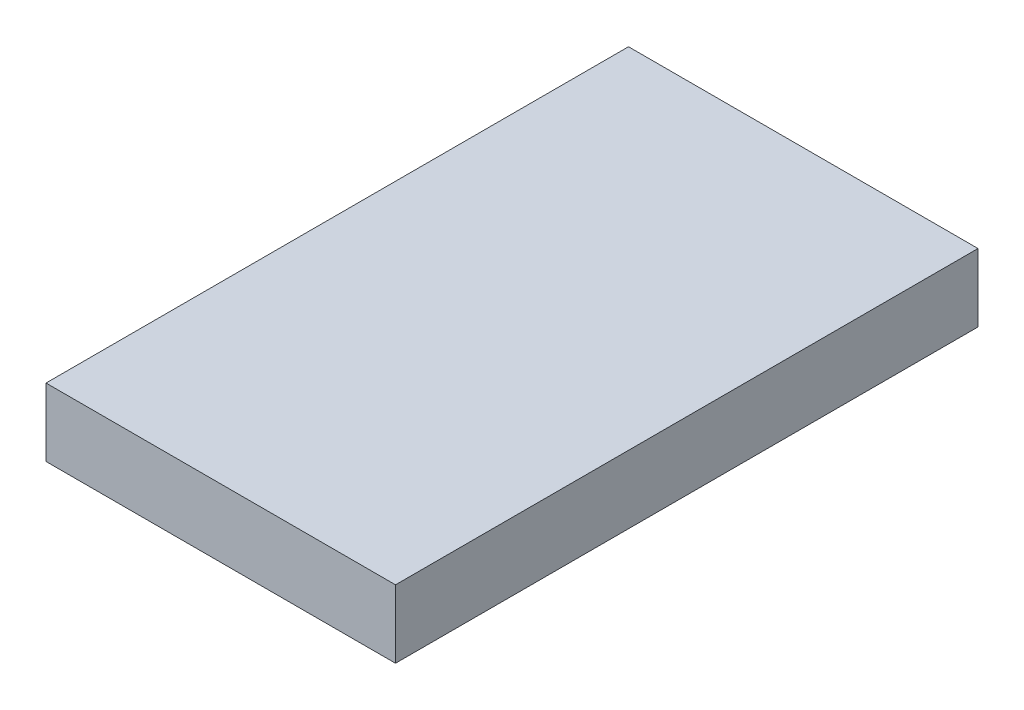
ISO-10303-21;
HEADER;
FILE_DESCRIPTION(('STEP AP214'),'2;1');
FILE_NAME('part.step','',(''),(''),'','','');
FILE_SCHEMA(('AUTOMOTIVE_DESIGN { 1 0 10303 214 1 1 1 1 }'));
ENDSEC;
DATA;
#1=APPLICATION_CONTEXT('core data for automotive mechanical design processes');
#2=APPLICATION_PROTOCOL_DEFINITION('international standard','automotive_design',2000,#1);
#3=PRODUCT_CONTEXT('',#1,'mechanical');
#4=PRODUCT('Part','Part','',(#3));
#5=PRODUCT_RELATED_PRODUCT_CATEGORY('part','',(#4));
#6=PRODUCT_DEFINITION_FORMATION('','',#4);
#7=PRODUCT_DEFINITION_CONTEXT('part definition',#1,'design');
#8=PRODUCT_DEFINITION('design','',#6,#7);
#9=PRODUCT_DEFINITION_SHAPE('','',#8);
#10=(LENGTH_UNIT() NAMED_UNIT(*) SI_UNIT(.MILLI.,.METRE.));
#11=(NAMED_UNIT(*) PLANE_ANGLE_UNIT() SI_UNIT($,.RADIAN.));
#12=(NAMED_UNIT(*) SI_UNIT($,.STERADIAN.) SOLID_ANGLE_UNIT());
#13=UNCERTAINTY_MEASURE_WITH_UNIT(LENGTH_MEASURE(1.E-05),#10,'distance_accuracy_value','');
#14=(GEOMETRIC_REPRESENTATION_CONTEXT(3) GLOBAL_UNCERTAINTY_ASSIGNED_CONTEXT((#13)) GLOBAL_UNIT_ASSIGNED_CONTEXT((#10,
#11,#12)) REPRESENTATION_CONTEXT('',''));
#15=CARTESIAN_POINT('',(0.,0.,0.));
#16=DIRECTION('',(0.,0.,1.));
#17=DIRECTION('',(1.,0.,0.));
#18=AXIS2_PLACEMENT_3D('',#15,#16,#17);
#19=CARTESIAN_POINT('',(18.,3.5,-30.));
#20=DIRECTION('',(-1.,0.,0.));
#21=DIRECTION('',(0.,0.,1.));
#22=AXIS2_PLACEMENT_3D('',#19,#20,#21);
#23=PLANE('',#22);
#24=DIRECTION('',(0.,0.,-1.));
#25=VECTOR('',#24,1.);
#26=CARTESIAN_POINT('',(18.,-3.5,-30.));
#27=LINE('',#26,#25);
#28=CARTESIAN_POINT('',(18.,-3.5,30.));
#29=VERTEX_POINT('',#28);
#30=CARTESIAN_POINT('',(18.,-3.5,-30.));
#31=VERTEX_POINT('',#30);
#32=EDGE_CURVE('E113',#29,#31,#27,.T.);
#33=ORIENTED_EDGE('',*,*,#32,.T.);
#34=DIRECTION('',(0.,-1.,0.));
#35=VECTOR('',#34,1.);
#36=CARTESIAN_POINT('',(18.,3.5,-30.));
#37=LINE('',#36,#35);
#38=CARTESIAN_POINT('',(18.,3.5,-30.));
#39=VERTEX_POINT('',#38);
#40=EDGE_CURVE('E11',#39,#31,#37,.T.);
#41=ORIENTED_EDGE('',*,*,#40,.F.);
#42=DIRECTION('',(0.,0.,-1.));
#43=VECTOR('',#42,1.);
#44=CARTESIAN_POINT('',(18.,3.5,-30.));
#45=LINE('',#44,#43);
#46=CARTESIAN_POINT('',(18.,3.5,30.));
#47=VERTEX_POINT('',#46);
#48=EDGE_CURVE('E97',#47,#39,#45,.T.);
#49=ORIENTED_EDGE('',*,*,#48,.F.);
#50=DIRECTION('',(0.,-1.,0.));
#51=VECTOR('',#50,1.);
#52=CARTESIAN_POINT('',(18.,3.5,30.));
#53=LINE('',#52,#51);
#54=EDGE_CURVE('E109',#47,#29,#53,.T.);
#55=ORIENTED_EDGE('',*,*,#54,.T.);
#56=EDGE_LOOP('',(#33,#41,#49,#55));
#57=FACE_BOUND('',#56,.T.);
#58=ADVANCED_FACE('F45',(#57),#23,.F.);
#59=CARTESIAN_POINT('',(-18.,3.5,-30.));
#60=DIRECTION('',(0.,0.,1.));
#61=DIRECTION('',(1.,0.,0.));
#62=AXIS2_PLACEMENT_3D('',#59,#60,#61);
#63=PLANE('',#62);
#64=DIRECTION('',(-1.,0.,0.));
#65=VECTOR('',#64,1.);
#66=CARTESIAN_POINT('',(-18.,-3.5,-30.));
#67=LINE('',#66,#65);
#68=CARTESIAN_POINT('',(-18.,-3.5,-30.));
#69=VERTEX_POINT('',#68);
#70=EDGE_CURVE('E102',#31,#69,#67,.T.);
#71=ORIENTED_EDGE('',*,*,#70,.T.);
#72=DIRECTION('',(0.,-1.,0.));
#73=VECTOR('',#72,1.);
#74=CARTESIAN_POINT('',(-18.,3.5,-30.));
#75=LINE('',#74,#73);
#76=CARTESIAN_POINT('',(-18.,3.5,-30.));
#77=VERTEX_POINT('',#76);
#78=EDGE_CURVE('E54',#77,#69,#75,.T.);
#79=ORIENTED_EDGE('',*,*,#78,.F.);
#80=DIRECTION('',(-1.,0.,0.));
#81=VECTOR('',#80,1.);
#82=CARTESIAN_POINT('',(-18.,3.5,-30.));
#83=LINE('',#82,#81);
#84=EDGE_CURVE('E92',#39,#77,#83,.T.);
#85=ORIENTED_EDGE('',*,*,#84,.F.);
#86=ORIENTED_EDGE('',*,*,#40,.T.);
#87=EDGE_LOOP('',(#71,#79,#85,#86));
#88=FACE_BOUND('',#87,.T.);
#89=ADVANCED_FACE('F101',(#88),#63,.F.);
#90=CARTESIAN_POINT('',(-18.,3.5,-30.));
#91=DIRECTION('',(1.,0.,0.));
#92=DIRECTION('',(0.,0.,-1.));
#93=AXIS2_PLACEMENT_3D('',#90,#91,#92);
#94=PLANE('',#93);
#95=DIRECTION('',(0.,0.,1.));
#96=VECTOR('',#95,1.);
#97=CARTESIAN_POINT('',(-18.,-3.5,-30.));
#98=LINE('',#97,#96);
#99=CARTESIAN_POINT('',(-18.,-3.5,30.));
#100=VERTEX_POINT('',#99);
#101=EDGE_CURVE('E79',#69,#100,#98,.T.);
#102=ORIENTED_EDGE('',*,*,#101,.T.);
#103=DIRECTION('',(0.,-1.,0.));
#104=VECTOR('',#103,1.);
#105=CARTESIAN_POINT('',(-18.,3.5,30.));
#106=LINE('',#105,#104);
#107=CARTESIAN_POINT('',(-18.,3.5,30.));
#108=VERTEX_POINT('',#107);
#109=EDGE_CURVE('E104',#108,#100,#106,.T.);
#110=ORIENTED_EDGE('',*,*,#109,.F.);
#111=DIRECTION('',(0.,0.,1.));
#112=VECTOR('',#111,1.);
#113=CARTESIAN_POINT('',(-18.,3.5,-30.));
#114=LINE('',#113,#112);
#115=EDGE_CURVE('E95',#77,#108,#114,.T.);
#116=ORIENTED_EDGE('',*,*,#115,.F.);
#117=ORIENTED_EDGE('',*,*,#78,.T.);
#118=EDGE_LOOP('',(#102,#110,#116,#117));
#119=FACE_BOUND('',#118,.T.);
#120=ADVANCED_FACE('F105',(#119),#94,.F.);
#121=CARTESIAN_POINT('',(-18.,3.5,30.));
#122=DIRECTION('',(0.,0.,-1.));
#123=DIRECTION('',(-1.,0.,0.));
#124=AXIS2_PLACEMENT_3D('',#121,#122,#123);
#125=PLANE('',#124);
#126=DIRECTION('',(1.,0.,0.));
#127=VECTOR('',#126,1.);
#128=CARTESIAN_POINT('',(-18.,-3.5,30.));
#129=LINE('',#128,#127);
#130=EDGE_CURVE('E85',#100,#29,#129,.T.);
#131=ORIENTED_EDGE('',*,*,#130,.T.);
#132=ORIENTED_EDGE('',*,*,#54,.F.);
#133=DIRECTION('',(1.,0.,0.));
#134=VECTOR('',#133,1.);
#135=CARTESIAN_POINT('',(-18.,3.5,30.));
#136=LINE('',#135,#134);
#137=EDGE_CURVE('E62',#108,#47,#136,.T.);
#138=ORIENTED_EDGE('',*,*,#137,.F.);
#139=ORIENTED_EDGE('',*,*,#109,.T.);
#140=EDGE_LOOP('',(#131,#132,#138,#139));
#141=FACE_BOUND('',#140,.T.);
#142=ADVANCED_FACE('F126',(#141),#125,.F.);
#143=CARTESIAN_POINT('',(0.,3.5,0.));
#144=DIRECTION('',(0.,1.,0.));
#145=DIRECTION('',(0.,0.,1.));
#146=AXIS2_PLACEMENT_3D('',#143,#144,#145);
#147=PLANE('',#146);
#148=ORIENTED_EDGE('',*,*,#48,.T.);
#149=ORIENTED_EDGE('',*,*,#84,.T.);
#150=ORIENTED_EDGE('',*,*,#115,.T.);
#151=ORIENTED_EDGE('',*,*,#137,.T.);
#152=EDGE_LOOP('',(#148,#149,#150,#151));
#153=FACE_BOUND('',#152,.T.);
#154=ADVANCED_FACE('F93',(#153),#147,.T.);
#155=CARTESIAN_POINT('',(0.,-3.5,0.));
#156=DIRECTION('',(0.,1.,0.));
#157=DIRECTION('',(0.,0.,1.));
#158=AXIS2_PLACEMENT_3D('',#155,#156,#157);
#159=PLANE('',#158);
#160=ORIENTED_EDGE('',*,*,#32,.F.);
#161=ORIENTED_EDGE('',*,*,#130,.F.);
#162=ORIENTED_EDGE('',*,*,#101,.F.);
#163=ORIENTED_EDGE('',*,*,#70,.F.);
#164=EDGE_LOOP('',(#160,#161,#162,#163));
#165=FACE_BOUND('',#164,.T.);
#166=ADVANCED_FACE('F129',(#165),#159,.F.);
#167=CLOSED_SHELL('',(#58,#89,#120,#142,#154,#166));
#168=MANIFOLD_SOLID_BREP('B2',#167);
#169=ADVANCED_BREP_SHAPE_REPRESENTATION('',(#18,#168),#14);
#170=SHAPE_DEFINITION_REPRESENTATION(#9,#169);
ENDSEC;
END-ISO-10303-21;
